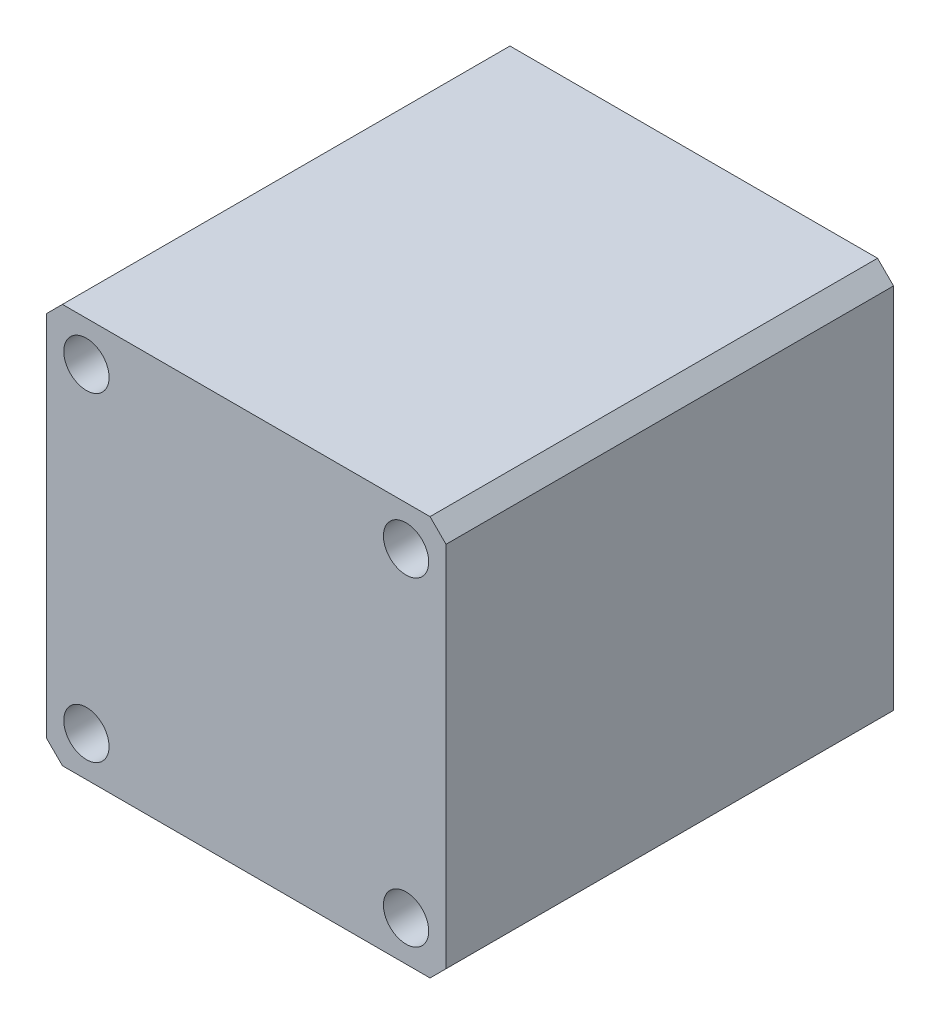
ISO-10303-21;
HEADER;
FILE_DESCRIPTION(('STEP AP214'),'2;1');
FILE_NAME('part.step','',(''),(''),'','','');
FILE_SCHEMA(('AUTOMOTIVE_DESIGN { 1 0 10303 214 1 1 1 1 }'));
ENDSEC;
DATA;
#1=APPLICATION_CONTEXT('core data for automotive mechanical design processes');
#2=APPLICATION_PROTOCOL_DEFINITION('international standard','automotive_design',2000,#1);
#3=PRODUCT_CONTEXT('',#1,'mechanical');
#4=PRODUCT('Part','Part','',(#3));
#5=PRODUCT_RELATED_PRODUCT_CATEGORY('part','',(#4));
#6=PRODUCT_DEFINITION_FORMATION('','',#4);
#7=PRODUCT_DEFINITION_CONTEXT('part definition',#1,'design');
#8=PRODUCT_DEFINITION('design','',#6,#7);
#9=PRODUCT_DEFINITION_SHAPE('','',#8);
#10=(LENGTH_UNIT() NAMED_UNIT(*) SI_UNIT(.MILLI.,.METRE.));
#11=(NAMED_UNIT(*) PLANE_ANGLE_UNIT() SI_UNIT($,.RADIAN.));
#12=(NAMED_UNIT(*) SI_UNIT($,.STERADIAN.) SOLID_ANGLE_UNIT());
#13=UNCERTAINTY_MEASURE_WITH_UNIT(LENGTH_MEASURE(1.E-05),#10,'distance_accuracy_value','');
#14=(GEOMETRIC_REPRESENTATION_CONTEXT(3) GLOBAL_UNCERTAINTY_ASSIGNED_CONTEXT((#13)) GLOBAL_UNIT_ASSIGNED_CONTEXT((#10,
#11,#12)) REPRESENTATION_CONTEXT('',''));
#15=CARTESIAN_POINT('',(0.,0.,0.));
#16=DIRECTION('',(0.,0.,1.));
#17=DIRECTION('',(1.,0.,0.));
#18=AXIS2_PLACEMENT_3D('',#15,#16,#17);
#19=CARTESIAN_POINT('',(0.,0.,84.));
#20=DIRECTION('',(1.,0.,0.));
#21=DIRECTION('',(0.,1.,0.));
#22=AXIS2_PLACEMENT_3D('',#19,#20,#21);
#23=PLANE('',#22);
#24=DIRECTION('',(0.,-1.,0.));
#25=VECTOR('',#24,1.);
#26=CARTESIAN_POINT('',(0.,0.,0.));
#27=LINE('',#26,#25);
#28=CARTESIAN_POINT('',(0.,-3.,0.));
#29=VERTEX_POINT('',#28);
#30=CARTESIAN_POINT('',(0.,-72.,0.));
#31=VERTEX_POINT('',#30);
#32=EDGE_CURVE('E136',#29,#31,#27,.T.);
#33=ORIENTED_EDGE('',*,*,#32,.T.);
#34=DIRECTION('',(0.,0.,1.));
#35=VECTOR('',#34,1.);
#36=CARTESIAN_POINT('',(0.,-72.,84.));
#37=LINE('',#36,#35);
#38=CARTESIAN_POINT('',(0.,-72.,84.));
#39=VERTEX_POINT('',#38);
#40=EDGE_CURVE('E11',#31,#39,#37,.T.);
#41=ORIENTED_EDGE('',*,*,#40,.T.);
#42=DIRECTION('',(0.,-1.,0.));
#43=VECTOR('',#42,1.);
#44=CARTESIAN_POINT('',(0.,0.,84.));
#45=LINE('',#44,#43);
#46=CARTESIAN_POINT('',(0.,-3.,84.));
#47=VERTEX_POINT('',#46);
#48=EDGE_CURVE('E134',#47,#39,#45,.T.);
#49=ORIENTED_EDGE('',*,*,#48,.F.);
#50=DIRECTION('',(0.,0.,-1.));
#51=VECTOR('',#50,1.);
#52=CARTESIAN_POINT('',(0.,-3.,84.));
#53=LINE('',#52,#51);
#54=EDGE_CURVE('E48',#47,#29,#53,.T.);
#55=ORIENTED_EDGE('',*,*,#54,.T.);
#56=EDGE_LOOP('',(#33,#41,#49,#55));
#57=FACE_BOUND('',#56,.T.);
#58=ADVANCED_FACE('F39',(#57),#23,.F.);
#59=CARTESIAN_POINT('',(0.,-75.,84.));
#60=DIRECTION('',(0.,1.,0.));
#61=DIRECTION('',(0.,0.,1.));
#62=AXIS2_PLACEMENT_3D('',#59,#60,#61);
#63=PLANE('',#62);
#64=DIRECTION('',(1.,0.,0.));
#65=VECTOR('',#64,1.);
#66=CARTESIAN_POINT('',(0.,-75.,0.));
#67=LINE('',#66,#65);
#68=CARTESIAN_POINT('',(3.,-75.,0.));
#69=VERTEX_POINT('',#68);
#70=CARTESIAN_POINT('',(72.,-75.,0.));
#71=VERTEX_POINT('',#70);
#72=EDGE_CURVE('E132',#69,#71,#67,.T.);
#73=ORIENTED_EDGE('',*,*,#72,.T.);
#74=DIRECTION('',(0.,0.,1.));
#75=VECTOR('',#74,1.);
#76=CARTESIAN_POINT('',(72.,-75.,84.));
#77=LINE('',#76,#75);
#78=CARTESIAN_POINT('',(72.,-75.,84.));
#79=VERTEX_POINT('',#78);
#80=EDGE_CURVE('E111',#71,#79,#77,.T.);
#81=ORIENTED_EDGE('',*,*,#80,.T.);
#82=DIRECTION('',(1.,0.,0.));
#83=VECTOR('',#82,1.);
#84=CARTESIAN_POINT('',(0.,-75.,84.));
#85=LINE('',#84,#83);
#86=CARTESIAN_POINT('',(3.,-75.,84.));
#87=VERTEX_POINT('',#86);
#88=EDGE_CURVE('E176',#87,#79,#85,.T.);
#89=ORIENTED_EDGE('',*,*,#88,.F.);
#90=DIRECTION('',(0.,0.,-1.));
#91=VECTOR('',#90,1.);
#92=CARTESIAN_POINT('',(3.,-75.,84.));
#93=LINE('',#92,#91);
#94=EDGE_CURVE('E116',#87,#69,#93,.T.);
#95=ORIENTED_EDGE('',*,*,#94,.T.);
#96=EDGE_LOOP('',(#73,#81,#89,#95));
#97=FACE_BOUND('',#96,.T.);
#98=ADVANCED_FACE('F222',(#97),#63,.F.);
#99=CARTESIAN_POINT('',(75.,0.,84.));
#100=DIRECTION('',(-1.,0.,0.));
#101=DIRECTION('',(0.,-1.,0.));
#102=AXIS2_PLACEMENT_3D('',#99,#100,#101);
#103=PLANE('',#102);
#104=DIRECTION('',(0.,1.,0.));
#105=VECTOR('',#104,1.);
#106=CARTESIAN_POINT('',(75.,0.,84.));
#107=LINE('',#106,#105);
#108=CARTESIAN_POINT('',(75.,-72.,84.));
#109=VERTEX_POINT('',#108);
#110=CARTESIAN_POINT('',(75.,-3.00000000000002,84.));
#111=VERTEX_POINT('',#110);
#112=EDGE_CURVE('E125',#109,#111,#107,.T.);
#113=ORIENTED_EDGE('',*,*,#112,.F.);
#114=DIRECTION('',(0.,0.,-1.));
#115=VECTOR('',#114,1.);
#116=CARTESIAN_POINT('',(75.,-72.,84.));
#117=LINE('',#116,#115);
#118=CARTESIAN_POINT('',(75.,-72.,0.));
#119=VERTEX_POINT('',#118);
#120=EDGE_CURVE('E110',#109,#119,#117,.T.);
#121=ORIENTED_EDGE('',*,*,#120,.T.);
#122=DIRECTION('',(0.,1.,0.));
#123=VECTOR('',#122,1.);
#124=CARTESIAN_POINT('',(75.,0.,0.));
#125=LINE('',#124,#123);
#126=CARTESIAN_POINT('',(75.,-3.00000000000002,0.));
#127=VERTEX_POINT('',#126);
#128=EDGE_CURVE('E123',#119,#127,#125,.T.);
#129=ORIENTED_EDGE('',*,*,#128,.T.);
#130=DIRECTION('',(0.,0.,1.));
#131=VECTOR('',#130,1.);
#132=CARTESIAN_POINT('',(75.,-3.00000000000002,84.));
#133=LINE('',#132,#131);
#134=EDGE_CURVE('E127',#127,#111,#133,.T.);
#135=ORIENTED_EDGE('',*,*,#134,.T.);
#136=EDGE_LOOP('',(#113,#121,#129,#135));
#137=FACE_BOUND('',#136,.T.);
#138=ADVANCED_FACE('F122',(#137),#103,.F.);
#139=CARTESIAN_POINT('',(0.,0.,84.));
#140=DIRECTION('',(0.,-1.,0.));
#141=DIRECTION('',(0.,0.,-1.));
#142=AXIS2_PLACEMENT_3D('',#139,#140,#141);
#143=PLANE('',#142);
#144=DIRECTION('',(-1.,0.,0.));
#145=VECTOR('',#144,1.);
#146=CARTESIAN_POINT('',(0.,0.,84.));
#147=LINE('',#146,#145);
#148=CARTESIAN_POINT('',(72.,0.,84.));
#149=VERTEX_POINT('',#148);
#150=CARTESIAN_POINT('',(3.,0.,84.));
#151=VERTEX_POINT('',#150);
#152=EDGE_CURVE('E140',#149,#151,#147,.T.);
#153=ORIENTED_EDGE('',*,*,#152,.F.);
#154=DIRECTION('',(0.,0.,-1.));
#155=VECTOR('',#154,1.);
#156=CARTESIAN_POINT('',(72.,0.,84.));
#157=LINE('',#156,#155);
#158=CARTESIAN_POINT('',(72.,0.,0.));
#159=VERTEX_POINT('',#158);
#160=EDGE_CURVE('E157',#149,#159,#157,.T.);
#161=ORIENTED_EDGE('',*,*,#160,.T.);
#162=DIRECTION('',(-1.,0.,0.));
#163=VECTOR('',#162,1.);
#164=CARTESIAN_POINT('',(0.,0.,0.));
#165=LINE('',#164,#163);
#166=CARTESIAN_POINT('',(3.,0.,0.));
#167=VERTEX_POINT('',#166);
#168=EDGE_CURVE('E131',#159,#167,#165,.T.);
#169=ORIENTED_EDGE('',*,*,#168,.T.);
#170=DIRECTION('',(0.,0.,1.));
#171=VECTOR('',#170,1.);
#172=CARTESIAN_POINT('',(3.,0.,84.));
#173=LINE('',#172,#171);
#174=EDGE_CURVE('E55',#167,#151,#173,.T.);
#175=ORIENTED_EDGE('',*,*,#174,.T.);
#176=EDGE_LOOP('',(#153,#161,#169,#175));
#177=FACE_BOUND('',#176,.T.);
#178=ADVANCED_FACE('F214',(#177),#143,.F.);
#179=CARTESIAN_POINT('',(0.,0.,84.));
#180=DIRECTION('',(0.,0.,1.));
#181=DIRECTION('',(1.,0.,0.));
#182=AXIS2_PLACEMENT_3D('',#179,#180,#181);
#183=PLANE('',#182);
#184=CARTESIAN_POINT('',(7.50000000000062,-67.5,84.));
#185=DIRECTION('',(0.,0.,1.));
#186=DIRECTION('',(1.,0.,0.));
#187=AXIS2_PLACEMENT_3D('',#184,#185,#186);
#188=CIRCLE('',#187,4.25);
#189=CARTESIAN_POINT('',(11.7500000000006,-67.5,84.));
#190=VERTEX_POINT('',#189);
#191=EDGE_CURVE('E183',#190,#190,#188,.T.);
#192=ORIENTED_EDGE('',*,*,#191,.F.);
#193=EDGE_LOOP('',(#192));
#194=FACE_BOUND('',#193,.T.);
#195=CARTESIAN_POINT('',(67.5000000000006,-67.5,84.));
#196=DIRECTION('',(0.,0.,1.));
#197=DIRECTION('',(1.,0.,0.));
#198=AXIS2_PLACEMENT_3D('',#195,#196,#197);
#199=CIRCLE('',#198,4.25000000000001);
#200=CARTESIAN_POINT('',(71.7500000000006,-67.5,84.));
#201=VERTEX_POINT('',#200);
#202=EDGE_CURVE('E189',#201,#201,#199,.T.);
#203=ORIENTED_EDGE('',*,*,#202,.F.);
#204=EDGE_LOOP('',(#203));
#205=FACE_BOUND('',#204,.T.);
#206=CARTESIAN_POINT('',(67.5,-7.5,84.));
#207=DIRECTION('',(0.,0.,1.));
#208=DIRECTION('',(1.,0.,0.));
#209=AXIS2_PLACEMENT_3D('',#206,#207,#208);
#210=CIRCLE('',#209,4.24999999999999);
#211=CARTESIAN_POINT('',(71.75,-7.5,84.));
#212=VERTEX_POINT('',#211);
#213=EDGE_CURVE('E195',#212,#212,#210,.T.);
#214=ORIENTED_EDGE('',*,*,#213,.F.);
#215=EDGE_LOOP('',(#214));
#216=FACE_BOUND('',#215,.T.);
#217=CARTESIAN_POINT('',(7.5,-7.5,84.));
#218=DIRECTION('',(0.,0.,1.));
#219=DIRECTION('',(1.,0.,0.));
#220=AXIS2_PLACEMENT_3D('',#217,#218,#219);
#221=CIRCLE('',#220,4.25);
#222=CARTESIAN_POINT('',(11.75,-7.5,84.));
#223=VERTEX_POINT('',#222);
#224=EDGE_CURVE('E171',#223,#223,#221,.T.);
#225=ORIENTED_EDGE('',*,*,#224,.F.);
#226=EDGE_LOOP('',(#225));
#227=FACE_BOUND('',#226,.T.);
#228=ORIENTED_EDGE('',*,*,#88,.T.);
#229=DIRECTION('',(-0.707106781186549,-0.707106781186546,0.));
#230=VECTOR('',#229,1.);
#231=CARTESIAN_POINT('',(73.4999999999998,-73.5000000000002,84.));
#232=LINE('',#231,#230);
#233=EDGE_CURVE('E154',#79,#109,#232,.F.);
#234=ORIENTED_EDGE('',*,*,#233,.T.);
#235=ORIENTED_EDGE('',*,*,#112,.T.);
#236=DIRECTION('',(0.707106781186548,-0.707106781186547,0.));
#237=VECTOR('',#236,1.);
#238=CARTESIAN_POINT('',(36.,36.,84.));
#239=LINE('',#238,#237);
#240=EDGE_CURVE('E62',#111,#149,#239,.F.);
#241=ORIENTED_EDGE('',*,*,#240,.T.);
#242=ORIENTED_EDGE('',*,*,#152,.T.);
#243=DIRECTION('',(0.707106781186548,0.707106781186548,0.));
#244=VECTOR('',#243,1.);
#245=CARTESIAN_POINT('',(1.5,-1.5,84.));
#246=LINE('',#245,#244);
#247=EDGE_CURVE('E149',#151,#47,#246,.F.);
#248=ORIENTED_EDGE('',*,*,#247,.T.);
#249=ORIENTED_EDGE('',*,*,#48,.T.);
#250=DIRECTION('',(-0.707106781186544,0.707106781186551,0.));
#251=VECTOR('',#250,1.);
#252=CARTESIAN_POINT('',(-36.,-35.9999999999996,84.));
#253=LINE('',#252,#251);
#254=EDGE_CURVE('E151',#39,#87,#253,.F.);
#255=ORIENTED_EDGE('',*,*,#254,.T.);
#256=EDGE_LOOP('',(#228,#234,#235,#241,#242,#248,#249,#255));
#257=FACE_BOUND('',#256,.T.);
#258=ADVANCED_FACE('F211',(#194,#205,#216,#227,#257),#183,.T.);
#259=CARTESIAN_POINT('',(0.,0.,0.));
#260=DIRECTION('',(0.,0.,1.));
#261=DIRECTION('',(1.,0.,0.));
#262=AXIS2_PLACEMENT_3D('',#259,#260,#261);
#263=PLANE('',#262);
#264=CARTESIAN_POINT('',(7.50000000000062,-67.5,0.));
#265=DIRECTION('',(0.,0.,1.));
#266=DIRECTION('',(1.,0.,0.));
#267=AXIS2_PLACEMENT_3D('',#264,#265,#266);
#268=CIRCLE('',#267,4.25);
#269=CARTESIAN_POINT('',(11.7500000000006,-67.5,0.));
#270=VERTEX_POINT('',#269);
#271=EDGE_CURVE('E186',#270,#270,#268,.T.);
#272=ORIENTED_EDGE('',*,*,#271,.T.);
#273=EDGE_LOOP('',(#272));
#274=FACE_BOUND('',#273,.T.);
#275=CARTESIAN_POINT('',(67.5000000000006,-67.5,0.));
#276=DIRECTION('',(0.,0.,1.));
#277=DIRECTION('',(1.,0.,0.));
#278=AXIS2_PLACEMENT_3D('',#275,#276,#277);
#279=CIRCLE('',#278,4.25000000000001);
#280=CARTESIAN_POINT('',(71.7500000000006,-67.5,0.));
#281=VERTEX_POINT('',#280);
#282=EDGE_CURVE('E192',#281,#281,#279,.T.);
#283=ORIENTED_EDGE('',*,*,#282,.T.);
#284=EDGE_LOOP('',(#283));
#285=FACE_BOUND('',#284,.T.);
#286=CARTESIAN_POINT('',(67.5,-7.5,0.));
#287=DIRECTION('',(0.,0.,1.));
#288=DIRECTION('',(1.,0.,0.));
#289=AXIS2_PLACEMENT_3D('',#286,#287,#288);
#290=CIRCLE('',#289,4.24999999999999);
#291=CARTESIAN_POINT('',(71.75,-7.5,0.));
#292=VERTEX_POINT('',#291);
#293=EDGE_CURVE('E181',#292,#292,#290,.T.);
#294=ORIENTED_EDGE('',*,*,#293,.T.);
#295=EDGE_LOOP('',(#294));
#296=FACE_BOUND('',#295,.T.);
#297=CARTESIAN_POINT('',(7.5,-7.5,0.));
#298=DIRECTION('',(0.,0.,1.));
#299=DIRECTION('',(1.,0.,0.));
#300=AXIS2_PLACEMENT_3D('',#297,#298,#299);
#301=CIRCLE('',#300,4.25);
#302=CARTESIAN_POINT('',(11.75,-7.5,0.));
#303=VERTEX_POINT('',#302);
#304=EDGE_CURVE('E169',#303,#303,#301,.T.);
#305=ORIENTED_EDGE('',*,*,#304,.T.);
#306=EDGE_LOOP('',(#305));
#307=FACE_BOUND('',#306,.T.);
#308=ORIENTED_EDGE('',*,*,#128,.F.);
#309=DIRECTION('',(0.707106781186549,0.707106781186546,0.));
#310=VECTOR('',#309,1.);
#311=CARTESIAN_POINT('',(75.,-72.,0.));
#312=LINE('',#311,#310);
#313=EDGE_CURVE('E106',#119,#71,#312,.F.);
#314=ORIENTED_EDGE('',*,*,#313,.T.);
#315=ORIENTED_EDGE('',*,*,#72,.F.);
#316=DIRECTION('',(0.707106781186544,-0.707106781186551,0.));
#317=VECTOR('',#316,1.);
#318=CARTESIAN_POINT('',(3.,-75.,0.));
#319=LINE('',#318,#317);
#320=EDGE_CURVE('E143',#69,#31,#319,.F.);
#321=ORIENTED_EDGE('',*,*,#320,.T.);
#322=ORIENTED_EDGE('',*,*,#32,.F.);
#323=DIRECTION('',(-0.707106781186548,-0.707106781186548,0.));
#324=VECTOR('',#323,1.);
#325=CARTESIAN_POINT('',(0.,-3.,0.));
#326=LINE('',#325,#324);
#327=EDGE_CURVE('E126',#29,#167,#326,.F.);
#328=ORIENTED_EDGE('',*,*,#327,.T.);
#329=ORIENTED_EDGE('',*,*,#168,.F.);
#330=DIRECTION('',(-0.707106781186548,0.707106781186547,0.));
#331=VECTOR('',#330,1.);
#332=CARTESIAN_POINT('',(72.,0.,0.));
#333=LINE('',#332,#331);
#334=EDGE_CURVE('E117',#159,#127,#333,.F.);
#335=ORIENTED_EDGE('',*,*,#334,.T.);
#336=EDGE_LOOP('',(#308,#314,#315,#321,#322,#328,#329,#335));
#337=FACE_BOUND('',#336,.T.);
#338=ADVANCED_FACE('F129',(#274,#285,#296,#307,#337),#263,.F.);
#339=CARTESIAN_POINT('',(75.,-72.,84.));
#340=DIRECTION('',(-0.707106781186546,0.707106781186549,0.));
#341=DIRECTION('',(0.,0.,-1.));
#342=AXIS2_PLACEMENT_3D('',#339,#340,#341);
#343=PLANE('',#342);
#344=ORIENTED_EDGE('',*,*,#233,.F.);
#345=ORIENTED_EDGE('',*,*,#80,.F.);
#346=ORIENTED_EDGE('',*,*,#313,.F.);
#347=ORIENTED_EDGE('',*,*,#120,.F.);
#348=EDGE_LOOP('',(#344,#345,#346,#347));
#349=FACE_BOUND('',#348,.T.);
#350=ADVANCED_FACE('F109',(#349),#343,.F.);
#351=CARTESIAN_POINT('',(72.,0.,84.));
#352=DIRECTION('',(-0.707106781186547,-0.707106781186548,0.));
#353=DIRECTION('',(0.,0.,-1.));
#354=AXIS2_PLACEMENT_3D('',#351,#352,#353);
#355=PLANE('',#354);
#356=ORIENTED_EDGE('',*,*,#240,.F.);
#357=ORIENTED_EDGE('',*,*,#134,.F.);
#358=ORIENTED_EDGE('',*,*,#334,.F.);
#359=ORIENTED_EDGE('',*,*,#160,.F.);
#360=EDGE_LOOP('',(#356,#357,#358,#359));
#361=FACE_BOUND('',#360,.T.);
#362=ADVANCED_FACE('F232',(#361),#355,.F.);
#363=CARTESIAN_POINT('',(3.,-75.,84.));
#364=DIRECTION('',(0.707106781186551,0.707106781186544,0.));
#365=DIRECTION('',(0.,0.,-1.));
#366=AXIS2_PLACEMENT_3D('',#363,#364,#365);
#367=PLANE('',#366);
#368=ORIENTED_EDGE('',*,*,#254,.F.);
#369=ORIENTED_EDGE('',*,*,#40,.F.);
#370=ORIENTED_EDGE('',*,*,#320,.F.);
#371=ORIENTED_EDGE('',*,*,#94,.F.);
#372=EDGE_LOOP('',(#368,#369,#370,#371));
#373=FACE_BOUND('',#372,.T.);
#374=ADVANCED_FACE('F224',(#373),#367,.F.);
#375=CARTESIAN_POINT('',(0.,-3.,84.));
#376=DIRECTION('',(0.707106781186547,-0.707106781186547,0.));
#377=DIRECTION('',(0.,0.,-1.));
#378=AXIS2_PLACEMENT_3D('',#375,#376,#377);
#379=PLANE('',#378);
#380=ORIENTED_EDGE('',*,*,#247,.F.);
#381=ORIENTED_EDGE('',*,*,#174,.F.);
#382=ORIENTED_EDGE('',*,*,#327,.F.);
#383=ORIENTED_EDGE('',*,*,#54,.F.);
#384=EDGE_LOOP('',(#380,#381,#382,#383));
#385=FACE_BOUND('',#384,.T.);
#386=ADVANCED_FACE('F42',(#385),#379,.F.);
#387=CARTESIAN_POINT('',(7.5,-7.5,0.));
#388=DIRECTION('',(0.,0.,1.));
#389=DIRECTION('',(1.,0.,0.));
#390=AXIS2_PLACEMENT_3D('',#387,#388,#389);
#391=CYLINDRICAL_SURFACE('',#390,4.25);
#392=ORIENTED_EDGE('',*,*,#304,.F.);
#393=EDGE_LOOP('',(#392));
#394=FACE_BOUND('',#393,.T.);
#395=ORIENTED_EDGE('',*,*,#224,.T.);
#396=EDGE_LOOP('',(#395));
#397=FACE_BOUND('',#396,.T.);
#398=ADVANCED_FACE('F207',(#394,#397),#391,.F.);
#399=CARTESIAN_POINT('',(67.5,-7.5,0.));
#400=DIRECTION('',(0.,0.,1.));
#401=DIRECTION('',(1.,0.,0.));
#402=AXIS2_PLACEMENT_3D('',#399,#400,#401);
#403=CYLINDRICAL_SURFACE('',#402,4.24999999999999);
#404=ORIENTED_EDGE('',*,*,#293,.F.);
#405=EDGE_LOOP('',(#404));
#406=FACE_BOUND('',#405,.T.);
#407=ORIENTED_EDGE('',*,*,#213,.T.);
#408=EDGE_LOOP('',(#407));
#409=FACE_BOUND('',#408,.T.);
#410=ADVANCED_FACE('F203',(#406,#409),#403,.F.);
#411=CARTESIAN_POINT('',(67.5000000000006,-67.5,0.));
#412=DIRECTION('',(0.,0.,1.));
#413=DIRECTION('',(1.,0.,0.));
#414=AXIS2_PLACEMENT_3D('',#411,#412,#413);
#415=CYLINDRICAL_SURFACE('',#414,4.25000000000001);
#416=ORIENTED_EDGE('',*,*,#282,.F.);
#417=EDGE_LOOP('',(#416));
#418=FACE_BOUND('',#417,.T.);
#419=ORIENTED_EDGE('',*,*,#202,.T.);
#420=EDGE_LOOP('',(#419));
#421=FACE_BOUND('',#420,.T.);
#422=ADVANCED_FACE('F206',(#418,#421),#415,.F.);
#423=CARTESIAN_POINT('',(7.50000000000062,-67.5,0.));
#424=DIRECTION('',(0.,0.,1.));
#425=DIRECTION('',(1.,0.,0.));
#426=AXIS2_PLACEMENT_3D('',#423,#424,#425);
#427=CYLINDRICAL_SURFACE('',#426,4.25);
#428=ORIENTED_EDGE('',*,*,#271,.F.);
#429=EDGE_LOOP('',(#428));
#430=FACE_BOUND('',#429,.T.);
#431=ORIENTED_EDGE('',*,*,#191,.T.);
#432=EDGE_LOOP('',(#431));
#433=FACE_BOUND('',#432,.T.);
#434=ADVANCED_FACE('F268',(#430,#433),#427,.F.);
#435=CLOSED_SHELL('',(#58,#98,#138,#178,#258,#338,#350,#362,#374,#386,#398,#410,#422,#434));
#436=MANIFOLD_SOLID_BREP('B2',#435);
#437=ADVANCED_BREP_SHAPE_REPRESENTATION('',(#18,#436),#14);
#438=SHAPE_DEFINITION_REPRESENTATION(#9,#437);
ENDSEC;
END-ISO-10303-21;
